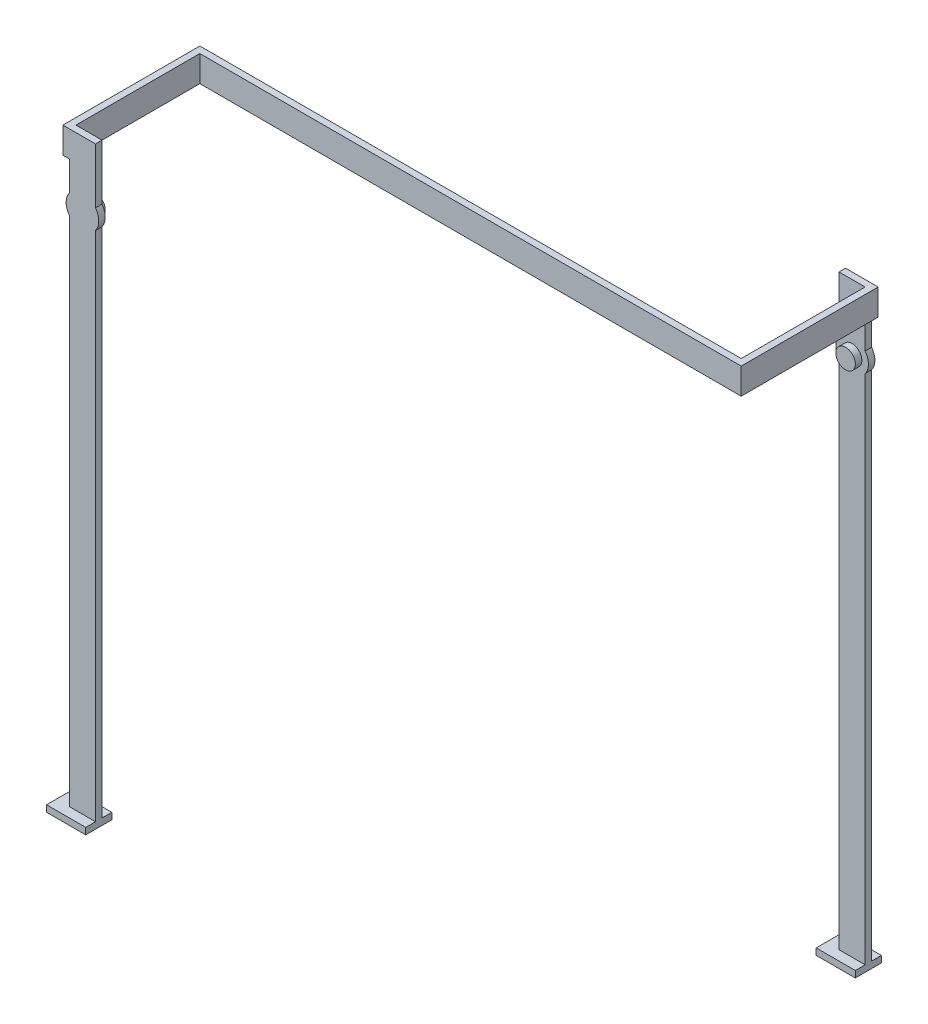
ISO-10303-21;
HEADER;
FILE_DESCRIPTION(('STEP AP214'),'2;1');
FILE_NAME('part.step','',(''),(''),'','','');
FILE_SCHEMA(('AUTOMOTIVE_DESIGN { 1 0 10303 214 1 1 1 1 }'));
ENDSEC;
DATA;
#1=APPLICATION_CONTEXT('core data for automotive mechanical design processes');
#2=APPLICATION_PROTOCOL_DEFINITION('international standard','automotive_design',2000,#1);
#3=PRODUCT_CONTEXT('',#1,'mechanical');
#4=PRODUCT('Part','Part','',(#3));
#5=PRODUCT_RELATED_PRODUCT_CATEGORY('part','',(#4));
#6=PRODUCT_DEFINITION_FORMATION('','',#4);
#7=PRODUCT_DEFINITION_CONTEXT('part definition',#1,'design');
#8=PRODUCT_DEFINITION('design','',#6,#7);
#9=PRODUCT_DEFINITION_SHAPE('','',#8);
#10=(LENGTH_UNIT() NAMED_UNIT(*) SI_UNIT(.MILLI.,.METRE.));
#11=(NAMED_UNIT(*) PLANE_ANGLE_UNIT() SI_UNIT($,.RADIAN.));
#12=(NAMED_UNIT(*) SI_UNIT($,.STERADIAN.) SOLID_ANGLE_UNIT());
#13=UNCERTAINTY_MEASURE_WITH_UNIT(LENGTH_MEASURE(1.E-05),#10,'distance_accuracy_value','');
#14=(GEOMETRIC_REPRESENTATION_CONTEXT(3) GLOBAL_UNCERTAINTY_ASSIGNED_CONTEXT((#13)) GLOBAL_UNIT_ASSIGNED_CONTEXT((#10,
#11,#12)) REPRESENTATION_CONTEXT('',''));
#15=CARTESIAN_POINT('',(0.,0.,0.));
#16=DIRECTION('',(0.,0.,1.));
#17=DIRECTION('',(1.,0.,0.));
#18=AXIS2_PLACEMENT_3D('',#15,#16,#17);
#19=CARTESIAN_POINT('',(25.7222833277674,47.5928129760567,-20.5));
#20=DIRECTION('',(-1.,0.,0.));
#21=DIRECTION('',(0.,0.,1.));
#22=AXIS2_PLACEMENT_3D('',#19,#20,#21);
#23=PLANE('',#22);
#24=DIRECTION('',(0.,0.,-1.));
#25=VECTOR('',#24,1.);
#26=CARTESIAN_POINT('',(25.7222833277674,47.5928129760567,-20.5));
#27=LINE('',#26,#25);
#28=CARTESIAN_POINT('',(25.7222833277674,47.5928129760567,-0.499999999999997));
#29=VERTEX_POINT('',#28);
#30=CARTESIAN_POINT('',(25.7222833277674,47.5928129760567,-19.5));
#31=VERTEX_POINT('',#30);
#32=EDGE_CURVE('E414',#29,#31,#27,.T.);
#33=ORIENTED_EDGE('',*,*,#32,.F.);
#34=DIRECTION('',(0.,1.,0.));
#35=VECTOR('',#34,1.);
#36=CARTESIAN_POINT('',(25.7222833277674,51.5928129760567,-0.5));
#37=LINE('',#36,#35);
#38=CARTESIAN_POINT('',(25.7222833277674,51.5928129760567,-0.5));
#39=VERTEX_POINT('',#38);
#40=EDGE_CURVE('E49',#29,#39,#37,.T.);
#41=ORIENTED_EDGE('',*,*,#40,.T.);
#42=DIRECTION('',(0.,0.,1.));
#43=VECTOR('',#42,1.);
#44=CARTESIAN_POINT('',(25.7222833277674,51.5928129760615,-20.5));
#45=LINE('',#44,#43);
#46=CARTESIAN_POINT('',(25.7222833277674,51.5928129760615,-19.5));
#47=VERTEX_POINT('',#46);
#48=EDGE_CURVE('E409',#47,#39,#45,.T.);
#49=ORIENTED_EDGE('',*,*,#48,.F.);
#50=DIRECTION('',(0.,-1.,0.));
#51=VECTOR('',#50,1.);
#52=CARTESIAN_POINT('',(25.7222833277674,51.5928129760615,-19.5));
#53=LINE('',#52,#51);
#54=EDGE_CURVE('E327',#47,#31,#53,.T.);
#55=ORIENTED_EDGE('',*,*,#54,.T.);
#56=EDGE_LOOP('',(#33,#41,#49,#55));
#57=FACE_BOUND('',#56,.T.);
#58=ADVANCED_FACE('F31',(#57),#23,.T.);
#59=CARTESIAN_POINT('',(25.7222833277674,51.5928129760615,-20.5));
#60=DIRECTION('',(-1.,0.,0.));
#61=DIRECTION('',(0.,-1.,0.));
#62=AXIS2_PLACEMENT_3D('',#59,#60,#61);
#63=PLANE('',#62);
#64=CARTESIAN_POINT('',(25.7222833277674,47.5928129760567,-20.5));
#65=VERTEX_POINT('',#64);
#66=EDGE_CURVE('E422',#31,#65,#27,.T.);
#67=ORIENTED_EDGE('',*,*,#66,.F.);
#68=CARTESIAN_POINT('',(25.7222833277674,43.092812976061,-19.5));
#69=VERTEX_POINT('',#68);
#70=EDGE_CURVE('E333',#31,#69,#53,.T.);
#71=ORIENTED_EDGE('',*,*,#70,.T.);
#72=DIRECTION('',(0.,0.,1.));
#73=VECTOR('',#72,1.);
#74=CARTESIAN_POINT('',(25.7222833277674,43.092812976061,-20.5));
#75=LINE('',#74,#73);
#76=CARTESIAN_POINT('',(25.7222833277674,43.092812976061,-20.5));
#77=VERTEX_POINT('',#76);
#78=EDGE_CURVE('E311',#77,#69,#75,.T.);
#79=ORIENTED_EDGE('',*,*,#78,.F.);
#80=DIRECTION('',(0.,-1.,0.));
#81=VECTOR('',#80,1.);
#82=CARTESIAN_POINT('',(25.7222833277674,51.5928129760615,-20.5));
#83=LINE('',#82,#81);
#84=EDGE_CURVE('E313',#65,#77,#83,.T.);
#85=ORIENTED_EDGE('',*,*,#84,.F.);
#86=EDGE_LOOP('',(#67,#71,#79,#85));
#87=FACE_BOUND('',#86,.T.);
#88=ADVANCED_FACE('F455',(#87),#63,.F.);
#89=CARTESIAN_POINT('',(23.7222833277671,41.5928129760615,-19.5));
#90=DIRECTION('',(0.,0.,-1.));
#91=DIRECTION('',(0.,1.,0.));
#92=AXIS2_PLACEMENT_3D('',#89,#90,#91);
#93=PLANE('',#92);
#94=DIRECTION('',(-1.,0.,0.));
#95=VECTOR('',#94,1.);
#96=CARTESIAN_POINT('',(25.7222833277674,-38.4071870239385,-19.5));
#97=LINE('',#96,#95);
#98=CARTESIAN_POINT('',(25.7222833277674,-38.4071870239431,-19.5));
#99=VERTEX_POINT('',#98);
#100=CARTESIAN_POINT('',(21.7222833277674,-38.4071870239385,-19.5));
#101=VERTEX_POINT('',#100);
#102=EDGE_CURVE('E35',#99,#101,#97,.T.);
#103=ORIENTED_EDGE('',*,*,#102,.F.);
#104=DIRECTION('',(0.,-1.,0.));
#105=VECTOR('',#104,1.);
#106=CARTESIAN_POINT('',(25.7222833277674,40.092812976062,-19.5));
#107=LINE('',#106,#105);
#108=CARTESIAN_POINT('',(25.7222833277674,40.092812976062,-19.5));
#109=VERTEX_POINT('',#108);
#110=EDGE_CURVE('E321',#109,#99,#107,.T.);
#111=ORIENTED_EDGE('',*,*,#110,.F.);
#112=CARTESIAN_POINT('',(23.7222833277671,41.5928129760615,-19.5));
#113=DIRECTION('',(0.,0.,-1.));
#114=DIRECTION('',(0.,1.,0.));
#115=AXIS2_PLACEMENT_3D('',#112,#113,#114);
#116=CIRCLE('',#115,2.49999999999991);
#117=EDGE_CURVE('E322',#69,#109,#116,.T.);
#118=ORIENTED_EDGE('',*,*,#117,.F.);
#119=ORIENTED_EDGE('',*,*,#70,.F.);
#120=ORIENTED_EDGE('',*,*,#54,.F.);
#121=DIRECTION('',(1.,0.,0.));
#122=VECTOR('',#121,1.);
#123=CARTESIAN_POINT('',(25.7222833277674,51.5928129760615,-19.5));
#124=LINE('',#123,#122);
#125=CARTESIAN_POINT('',(21.7222833277674,51.5928129760615,-19.5));
#126=VERTEX_POINT('',#125);
#127=EDGE_CURVE('E446',#126,#47,#124,.T.);
#128=ORIENTED_EDGE('',*,*,#127,.F.);
#129=DIRECTION('',(0.,1.,0.));
#130=VECTOR('',#129,1.);
#131=CARTESIAN_POINT('',(21.7222833277674,51.5928129760615,-19.5));
#132=LINE('',#131,#130);
#133=CARTESIAN_POINT('',(21.7222833277674,43.0928129760617,-19.5));
#134=VERTEX_POINT('',#133);
#135=EDGE_CURVE('E445',#134,#126,#132,.T.);
#136=ORIENTED_EDGE('',*,*,#135,.F.);
#137=CARTESIAN_POINT('',(23.7222833277671,41.5928129760615,-19.5));
#138=DIRECTION('',(0.,0.,-1.));
#139=DIRECTION('',(0.,1.,0.));
#140=AXIS2_PLACEMENT_3D('',#137,#138,#139);
#141=CIRCLE('',#140,2.49999999999992);
#142=CARTESIAN_POINT('',(21.7222833277674,40.0928129760613,-19.5));
#143=VERTEX_POINT('',#142);
#144=EDGE_CURVE('E443',#143,#134,#141,.T.);
#145=ORIENTED_EDGE('',*,*,#144,.F.);
#146=DIRECTION('',(0.,1.,0.));
#147=VECTOR('',#146,1.);
#148=CARTESIAN_POINT('',(21.7222833277674,40.0928129760613,-19.5));
#149=LINE('',#148,#147);
#150=EDGE_CURVE('E441',#101,#143,#149,.T.);
#151=ORIENTED_EDGE('',*,*,#150,.F.);
#152=EDGE_LOOP('',(#103,#111,#118,#119,#120,#128,#136,#145,#151));
#153=FACE_BOUND('',#152,.T.);
#154=CARTESIAN_POINT('',(23.7222833277671,41.5928129760615,-19.5));
#155=DIRECTION('',(0.,0.,-1.));
#156=DIRECTION('',(0.,1.,0.));
#157=AXIS2_PLACEMENT_3D('',#154,#155,#156);
#158=CIRCLE('',#157,1.50000000000001);
#159=CARTESIAN_POINT('',(23.7222833277671,43.0928129760615,-19.5));
#160=VERTEX_POINT('',#159);
#161=EDGE_CURVE('E11',#160,#160,#158,.F.);
#162=ORIENTED_EDGE('',*,*,#161,.F.);
#163=EDGE_LOOP('',(#162));
#164=FACE_BOUND('',#163,.T.);
#165=ADVANCED_FACE('F459',(#153,#164),#93,.F.);
#166=CARTESIAN_POINT('',(21.7222833277674,40.0928129760613,-20.5));
#167=DIRECTION('',(1.,0.,0.));
#168=DIRECTION('',(0.,1.,0.));
#169=AXIS2_PLACEMENT_3D('',#166,#167,#168);
#170=PLANE('',#169);
#171=ORIENTED_EDGE('',*,*,#150,.T.);
#172=DIRECTION('',(0.,0.,1.));
#173=VECTOR('',#172,1.);
#174=CARTESIAN_POINT('',(21.7222833277674,40.0928129760613,-20.5));
#175=LINE('',#174,#173);
#176=CARTESIAN_POINT('',(21.7222833277674,40.0928129760613,-20.5));
#177=VERTEX_POINT('',#176);
#178=EDGE_CURVE('E344',#177,#143,#175,.T.);
#179=ORIENTED_EDGE('',*,*,#178,.F.);
#180=DIRECTION('',(0.,1.,0.));
#181=VECTOR('',#180,1.);
#182=CARTESIAN_POINT('',(21.7222833277674,40.0928129760613,-20.5));
#183=LINE('',#182,#181);
#184=CARTESIAN_POINT('',(21.7222833277674,-38.4071870239385,-20.5));
#185=VERTEX_POINT('',#184);
#186=EDGE_CURVE('E326',#185,#177,#183,.T.);
#187=ORIENTED_EDGE('',*,*,#186,.F.);
#188=DIRECTION('',(0.,0.,1.));
#189=VECTOR('',#188,1.);
#190=CARTESIAN_POINT('',(21.7222833277674,-38.4071870239385,-20.5));
#191=LINE('',#190,#189);
#192=EDGE_CURVE('E41',#185,#101,#191,.T.);
#193=ORIENTED_EDGE('',*,*,#192,.T.);
#194=EDGE_LOOP('',(#171,#179,#187,#193));
#195=FACE_BOUND('',#194,.T.);
#196=ADVANCED_FACE('F33',(#195),#170,.F.);
#197=CARTESIAN_POINT('',(23.7222833277671,41.5928129760615,-20.5));
#198=DIRECTION('',(0.,0.,1.));
#199=DIRECTION('',(0.,-1.,0.));
#200=AXIS2_PLACEMENT_3D('',#197,#198,#199);
#201=CYLINDRICAL_SURFACE('',#200,2.49999999999992);
#202=ORIENTED_EDGE('',*,*,#144,.T.);
#203=DIRECTION('',(0.,0.,1.));
#204=VECTOR('',#203,1.);
#205=CARTESIAN_POINT('',(21.7222833277674,43.0928129760617,-20.5));
#206=LINE('',#205,#204);
#207=CARTESIAN_POINT('',(21.7222833277674,43.0928129760617,-20.5));
#208=VERTEX_POINT('',#207);
#209=EDGE_CURVE('E341',#208,#134,#206,.T.);
#210=ORIENTED_EDGE('',*,*,#209,.F.);
#211=CARTESIAN_POINT('',(23.7222833277671,41.5928129760615,-20.5));
#212=DIRECTION('',(0.,0.,-1.));
#213=DIRECTION('',(0.,1.,0.));
#214=AXIS2_PLACEMENT_3D('',#211,#212,#213);
#215=CIRCLE('',#214,2.49999999999992);
#216=EDGE_CURVE('E433',#177,#208,#215,.T.);
#217=ORIENTED_EDGE('',*,*,#216,.F.);
#218=ORIENTED_EDGE('',*,*,#178,.T.);
#219=EDGE_LOOP('',(#202,#210,#217,#218));
#220=FACE_BOUND('',#219,.T.);
#221=ADVANCED_FACE('F514',(#220),#201,.T.);
#222=CARTESIAN_POINT('',(21.7222833277674,51.5928129760615,-20.5));
#223=DIRECTION('',(1.,0.,0.));
#224=DIRECTION('',(0.,0.,-1.));
#225=AXIS2_PLACEMENT_3D('',#222,#223,#224);
#226=PLANE('',#225);
#227=ORIENTED_EDGE('',*,*,#135,.T.);
#228=DIRECTION('',(0.,0.,1.));
#229=VECTOR('',#228,1.);
#230=CARTESIAN_POINT('',(21.7222833277674,51.5928129760615,-20.5));
#231=LINE('',#230,#229);
#232=CARTESIAN_POINT('',(21.7222833277674,51.5928129760615,-20.5));
#233=VERTEX_POINT('',#232);
#234=EDGE_CURVE('E338',#233,#126,#231,.T.);
#235=ORIENTED_EDGE('',*,*,#234,.F.);
#236=DIRECTION('',(0.,1.,0.));
#237=VECTOR('',#236,1.);
#238=CARTESIAN_POINT('',(21.7222833277674,51.5928129760615,-20.5));
#239=LINE('',#238,#237);
#240=EDGE_CURVE('E435',#208,#233,#239,.T.);
#241=ORIENTED_EDGE('',*,*,#240,.F.);
#242=ORIENTED_EDGE('',*,*,#209,.T.);
#243=EDGE_LOOP('',(#227,#235,#241,#242));
#244=FACE_BOUND('',#243,.T.);
#245=ADVANCED_FACE('F512',(#244),#226,.F.);
#246=CARTESIAN_POINT('',(25.7222833277674,51.5928129760615,-20.5));
#247=DIRECTION('',(0.,-1.,0.));
#248=DIRECTION('',(0.,0.,-1.));
#249=AXIS2_PLACEMENT_3D('',#246,#247,#248);
#250=PLANE('',#249);
#251=ORIENTED_EDGE('',*,*,#127,.T.);
#252=ORIENTED_EDGE('',*,*,#48,.T.);
#253=DIRECTION('',(1.,0.,0.));
#254=VECTOR('',#253,1.);
#255=CARTESIAN_POINT('',(-57.2777166722292,51.592812976057,-0.5));
#256=LINE('',#255,#254);
#257=CARTESIAN_POINT('',(-57.2777166722292,51.592812976057,-0.5));
#258=VERTEX_POINT('',#257);
#259=EDGE_CURVE('E530',#258,#39,#256,.T.);
#260=ORIENTED_EDGE('',*,*,#259,.F.);
#261=DIRECTION('',(0.,0.,-1.));
#262=VECTOR('',#261,1.);
#263=CARTESIAN_POINT('',(-57.2777166722292,51.592812976057,20.5000000000002));
#264=LINE('',#263,#262);
#265=CARTESIAN_POINT('',(-57.2777166722292,51.592812976057,20.5000000000002));
#266=VERTEX_POINT('',#265);
#267=EDGE_CURVE('E533',#266,#258,#264,.T.);
#268=ORIENTED_EDGE('',*,*,#267,.F.);
#269=DIRECTION('',(-1.,0.,0.));
#270=VECTOR('',#269,1.);
#271=CARTESIAN_POINT('',(-56.2777166722293,51.592812976057,20.5000000000002));
#272=LINE('',#271,#270);
#273=CARTESIAN_POINT('',(-52.2777166722293,51.592812976057,20.5000000000002));
#274=VERTEX_POINT('',#273);
#275=EDGE_CURVE('E563',#274,#266,#272,.T.);
#276=ORIENTED_EDGE('',*,*,#275,.F.);
#277=DIRECTION('',(0.,0.,-1.));
#278=VECTOR('',#277,1.);
#279=CARTESIAN_POINT('',(-52.2777166722293,51.592812976057,20.5000000000002));
#280=LINE('',#279,#278);
#281=CARTESIAN_POINT('',(-52.2777166722293,51.592812976057,19.5000000000002));
#282=VERTEX_POINT('',#281);
#283=EDGE_CURVE('E397',#274,#282,#280,.T.);
#284=ORIENTED_EDGE('',*,*,#283,.T.);
#285=DIRECTION('',(-1.,0.,0.));
#286=VECTOR('',#285,1.);
#287=CARTESIAN_POINT('',(-56.2777166722293,51.592812976057,19.5000000000002));
#288=LINE('',#287,#286);
#289=CARTESIAN_POINT('',(-56.2777166722292,51.592812976057,19.5000000000002));
#290=VERTEX_POINT('',#289);
#291=EDGE_CURVE('E377',#282,#290,#288,.T.);
#292=ORIENTED_EDGE('',*,*,#291,.T.);
#293=DIRECTION('',(0.,0.,-1.));
#294=VECTOR('',#293,1.);
#295=CARTESIAN_POINT('',(-56.2777166722292,51.592812976057,20.5000000000002));
#296=LINE('',#295,#294);
#297=CARTESIAN_POINT('',(-56.2777166722293,51.592812976057,0.5));
#298=VERTEX_POINT('',#297);
#299=EDGE_CURVE('E549',#290,#298,#296,.T.);
#300=ORIENTED_EDGE('',*,*,#299,.T.);
#301=DIRECTION('',(-1.,0.,0.));
#302=VECTOR('',#301,1.);
#303=CARTESIAN_POINT('',(26.7222833277674,51.5928129760615,0.500000000000001));
#304=LINE('',#303,#302);
#305=CARTESIAN_POINT('',(26.7222833277674,51.5928129760615,0.500000000000001));
#306=VERTEX_POINT('',#305);
#307=EDGE_CURVE('E427',#306,#298,#304,.T.);
#308=ORIENTED_EDGE('',*,*,#307,.F.);
#309=DIRECTION('',(0.,0.,1.));
#310=VECTOR('',#309,1.);
#311=CARTESIAN_POINT('',(26.7222833277674,51.5928129760615,-20.5));
#312=LINE('',#311,#310);
#313=CARTESIAN_POINT('',(26.7222833277674,51.5928129760615,-20.5));
#314=VERTEX_POINT('',#313);
#315=EDGE_CURVE('E413',#314,#306,#312,.T.);
#316=ORIENTED_EDGE('',*,*,#315,.F.);
#317=DIRECTION('',(1.,0.,0.));
#318=VECTOR('',#317,1.);
#319=CARTESIAN_POINT('',(25.7222833277674,51.5928129760615,-20.5));
#320=LINE('',#319,#318);
#321=EDGE_CURVE('E437',#233,#314,#320,.T.);
#322=ORIENTED_EDGE('',*,*,#321,.F.);
#323=ORIENTED_EDGE('',*,*,#234,.T.);
#324=EDGE_LOOP('',(#251,#252,#260,#268,#276,#284,#292,#300,#308,#316,#322,#323));
#325=FACE_BOUND('',#324,.T.);
#326=ADVANCED_FACE('F508',(#325),#250,.F.);
#327=CARTESIAN_POINT('',(23.7222833277671,41.5928129760615,-20.5));
#328=DIRECTION('',(0.,0.,1.));
#329=DIRECTION('',(0.,-1.,0.));
#330=AXIS2_PLACEMENT_3D('',#327,#328,#329);
#331=CYLINDRICAL_SURFACE('',#330,2.49999999999991);
#332=ORIENTED_EDGE('',*,*,#117,.T.);
#333=DIRECTION('',(0.,0.,1.));
#334=VECTOR('',#333,1.);
#335=CARTESIAN_POINT('',(25.7222833277674,40.092812976062,-20.5));
#336=LINE('',#335,#334);
#337=CARTESIAN_POINT('',(25.7222833277674,40.092812976062,-20.5));
#338=VERTEX_POINT('',#337);
#339=EDGE_CURVE('E309',#338,#109,#336,.T.);
#340=ORIENTED_EDGE('',*,*,#339,.F.);
#341=CARTESIAN_POINT('',(23.7222833277671,41.5928129760615,-20.5));
#342=DIRECTION('',(0.,0.,-1.));
#343=DIRECTION('',(0.,1.,0.));
#344=AXIS2_PLACEMENT_3D('',#341,#342,#343);
#345=CIRCLE('',#344,2.49999999999991);
#346=EDGE_CURVE('E307',#77,#338,#345,.T.);
#347=ORIENTED_EDGE('',*,*,#346,.F.);
#348=ORIENTED_EDGE('',*,*,#78,.T.);
#349=EDGE_LOOP('',(#332,#340,#347,#348));
#350=FACE_BOUND('',#349,.T.);
#351=ADVANCED_FACE('F458',(#350),#331,.T.);
#352=CARTESIAN_POINT('',(25.7222833277674,40.092812976062,-20.5));
#353=DIRECTION('',(-1.,0.,0.));
#354=DIRECTION('',(0.,-1.,0.));
#355=AXIS2_PLACEMENT_3D('',#352,#353,#354);
#356=PLANE('',#355);
#357=ORIENTED_EDGE('',*,*,#110,.T.);
#358=DIRECTION('',(0.,0.,1.));
#359=VECTOR('',#358,1.);
#360=CARTESIAN_POINT('',(25.7222833277674,-38.4071870239431,-22.));
#361=LINE('',#360,#359);
#362=CARTESIAN_POINT('',(25.7222833277674,-38.4071870239431,-18.));
#363=VERTEX_POINT('',#362);
#364=EDGE_CURVE('E262',#99,#363,#361,.T.);
#365=ORIENTED_EDGE('',*,*,#364,.T.);
#366=DIRECTION('',(0.,1.,0.));
#367=VECTOR('',#366,1.);
#368=CARTESIAN_POINT('',(25.7222833277674,-39.4071870239431,-18.));
#369=LINE('',#368,#367);
#370=CARTESIAN_POINT('',(25.7222833277674,-39.4071870239431,-18.));
#371=VERTEX_POINT('',#370);
#372=EDGE_CURVE('E243',#371,#363,#369,.T.);
#373=ORIENTED_EDGE('',*,*,#372,.F.);
#374=DIRECTION('',(0.,0.,1.));
#375=VECTOR('',#374,1.);
#376=CARTESIAN_POINT('',(25.7222833277674,-39.4071870239431,-22.));
#377=LINE('',#376,#375);
#378=CARTESIAN_POINT('',(25.7222833277674,-39.4071870239431,-22.));
#379=VERTEX_POINT('',#378);
#380=EDGE_CURVE('E249',#379,#371,#377,.T.);
#381=ORIENTED_EDGE('',*,*,#380,.F.);
#382=DIRECTION('',(0.,1.,0.));
#383=VECTOR('',#382,1.);
#384=CARTESIAN_POINT('',(25.7222833277674,-39.4071870239431,-22.));
#385=LINE('',#384,#383);
#386=CARTESIAN_POINT('',(25.7222833277674,-38.4071870239431,-22.));
#387=VERTEX_POINT('',#386);
#388=EDGE_CURVE('E288',#379,#387,#385,.T.);
#389=ORIENTED_EDGE('',*,*,#388,.T.);
#390=CARTESIAN_POINT('',(25.7222833277674,-38.4071870239431,-20.5));
#391=VERTEX_POINT('',#390);
#392=EDGE_CURVE('E273',#387,#391,#361,.T.);
#393=ORIENTED_EDGE('',*,*,#392,.T.);
#394=DIRECTION('',(0.,-1.,0.));
#395=VECTOR('',#394,1.);
#396=CARTESIAN_POINT('',(25.7222833277674,40.092812976062,-20.5));
#397=LINE('',#396,#395);
#398=EDGE_CURVE('E304',#338,#391,#397,.T.);
#399=ORIENTED_EDGE('',*,*,#398,.F.);
#400=ORIENTED_EDGE('',*,*,#339,.T.);
#401=EDGE_LOOP('',(#357,#365,#373,#381,#389,#393,#399,#400));
#402=FACE_BOUND('',#401,.T.);
#403=ADVANCED_FACE('F261',(#402),#356,.F.);
#404=CARTESIAN_POINT('',(23.7222833277671,41.5928129760615,-20.5));
#405=DIRECTION('',(0.,0.,-1.));
#406=DIRECTION('',(0.,1.,0.));
#407=AXIS2_PLACEMENT_3D('',#404,#405,#406);
#408=PLANE('',#407);
#409=DIRECTION('',(-1.,0.,0.));
#410=VECTOR('',#409,1.);
#411=CARTESIAN_POINT('',(25.7222833277674,-38.4071870239385,-20.5));
#412=LINE('',#411,#410);
#413=EDGE_CURVE('E300',#391,#185,#412,.T.);
#414=ORIENTED_EDGE('',*,*,#413,.T.);
#415=ORIENTED_EDGE('',*,*,#186,.T.);
#416=ORIENTED_EDGE('',*,*,#216,.T.);
#417=ORIENTED_EDGE('',*,*,#240,.T.);
#418=ORIENTED_EDGE('',*,*,#321,.T.);
#419=DIRECTION('',(0.,1.,0.));
#420=VECTOR('',#419,1.);
#421=CARTESIAN_POINT('',(26.7222833277674,51.5928129760615,-20.5));
#422=LINE('',#421,#420);
#423=CARTESIAN_POINT('',(26.7222833277674,47.5928129760567,-20.5));
#424=VERTEX_POINT('',#423);
#425=EDGE_CURVE('E410',#424,#314,#422,.T.);
#426=ORIENTED_EDGE('',*,*,#425,.F.);
#427=DIRECTION('',(-1.,0.,0.));
#428=VECTOR('',#427,1.);
#429=CARTESIAN_POINT('',(26.7222833277674,47.5928129760567,-20.5));
#430=LINE('',#429,#428);
#431=EDGE_CURVE('E57',#424,#65,#430,.T.);
#432=ORIENTED_EDGE('',*,*,#431,.T.);
#433=ORIENTED_EDGE('',*,*,#84,.T.);
#434=ORIENTED_EDGE('',*,*,#346,.T.);
#435=ORIENTED_EDGE('',*,*,#398,.T.);
#436=EDGE_LOOP('',(#414,#415,#416,#417,#418,#426,#432,#433,#434,#435));
#437=FACE_BOUND('',#436,.T.);
#438=ADVANCED_FACE('F305',(#437),#408,.T.);
#439=CARTESIAN_POINT('',(23.7222833277671,41.5928129760615,-18.5));
#440=DIRECTION('',(0.,0.,-1.));
#441=DIRECTION('',(-1.,0.,0.));
#442=AXIS2_PLACEMENT_3D('',#439,#440,#441);
#443=CYLINDRICAL_SURFACE('',#442,1.50000000000001);
#444=CARTESIAN_POINT('',(23.7222833277671,41.5928129760615,-18.5));
#445=DIRECTION('',(0.,0.,1.));
#446=DIRECTION('',(1.,0.,0.));
#447=AXIS2_PLACEMENT_3D('',#444,#445,#446);
#448=CIRCLE('',#447,1.50000000000001);
#449=CARTESIAN_POINT('',(25.2222833277672,41.5928129760615,-18.5));
#450=VERTEX_POINT('',#449);
#451=EDGE_CURVE('E429',#450,#450,#448,.T.);
#452=ORIENTED_EDGE('',*,*,#451,.F.);
#453=EDGE_LOOP('',(#452));
#454=FACE_BOUND('',#453,.T.);
#455=ORIENTED_EDGE('',*,*,#161,.T.);
#456=EDGE_LOOP('',(#455));
#457=FACE_BOUND('',#456,.T.);
#458=ADVANCED_FACE('F496',(#454,#457),#443,.T.);
#459=CARTESIAN_POINT('',(23.7222833277671,41.5928129760615,-18.5));
#460=DIRECTION('',(0.,0.,1.));
#461=DIRECTION('',(1.,0.,0.));
#462=AXIS2_PLACEMENT_3D('',#459,#460,#461);
#463=PLANE('',#462);
#464=ORIENTED_EDGE('',*,*,#451,.T.);
#465=EDGE_LOOP('',(#464));
#466=FACE_BOUND('',#465,.T.);
#467=ADVANCED_FACE('F492',(#466),#463,.T.);
#468=CARTESIAN_POINT('',(26.7222833277674,51.5928129760615,0.500000000000001));
#469=DIRECTION('',(0.,0.,-1.));
#470=DIRECTION('',(0.,1.,0.));
#471=AXIS2_PLACEMENT_3D('',#468,#469,#470);
#472=PLANE('',#471);
#473=ORIENTED_EDGE('',*,*,#307,.T.);
#474=DIRECTION('',(0.,-1.,0.));
#475=VECTOR('',#474,1.);
#476=CARTESIAN_POINT('',(-56.2777166722293,51.592812976057,0.5));
#477=LINE('',#476,#475);
#478=CARTESIAN_POINT('',(-56.2777166722292,47.592812976057,0.499999999999997));
#479=VERTEX_POINT('',#478);
#480=EDGE_CURVE('E553',#298,#479,#477,.T.);
#481=ORIENTED_EDGE('',*,*,#480,.T.);
#482=DIRECTION('',(-1.,0.,0.));
#483=VECTOR('',#482,1.);
#484=CARTESIAN_POINT('',(26.7222833277674,47.5928129760567,0.5));
#485=LINE('',#484,#483);
#486=CARTESIAN_POINT('',(26.7222833277674,47.5928129760567,0.5));
#487=VERTEX_POINT('',#486);
#488=EDGE_CURVE('E425',#487,#479,#485,.T.);
#489=ORIENTED_EDGE('',*,*,#488,.F.);
#490=DIRECTION('',(0.,-1.,0.));
#491=VECTOR('',#490,1.);
#492=CARTESIAN_POINT('',(26.7222833277674,51.5928129760615,0.500000000000001));
#493=LINE('',#492,#491);
#494=EDGE_CURVE('E416',#306,#487,#493,.T.);
#495=ORIENTED_EDGE('',*,*,#494,.F.);
#496=EDGE_LOOP('',(#473,#481,#489,#495));
#497=FACE_BOUND('',#496,.T.);
#498=ADVANCED_FACE('F488',(#497),#472,.F.);
#499=CARTESIAN_POINT('',(26.7222833277674,47.5928129760567,-20.5));
#500=DIRECTION('',(0.,1.,0.));
#501=DIRECTION('',(0.,0.,1.));
#502=AXIS2_PLACEMENT_3D('',#499,#500,#501);
#503=PLANE('',#502);
#504=ORIENTED_EDGE('',*,*,#488,.T.);
#505=DIRECTION('',(0.,0.,1.));
#506=VECTOR('',#505,1.);
#507=CARTESIAN_POINT('',(-56.2777166722292,47.592812976057,20.5000000000002));
#508=LINE('',#507,#506);
#509=CARTESIAN_POINT('',(-56.2777166722292,47.592812976057,19.5000000000002));
#510=VERTEX_POINT('',#509);
#511=EDGE_CURVE('E554',#479,#510,#508,.T.);
#512=ORIENTED_EDGE('',*,*,#511,.T.);
#513=CARTESIAN_POINT('',(-56.2777166722293,47.592812976057,20.5000000000002));
#514=VERTEX_POINT('',#513);
#515=EDGE_CURVE('E552',#510,#514,#508,.T.);
#516=ORIENTED_EDGE('',*,*,#515,.T.);
#517=DIRECTION('',(1.,0.,0.));
#518=VECTOR('',#517,1.);
#519=CARTESIAN_POINT('',(-57.2777166722292,47.592812976057,20.5000000000002));
#520=LINE('',#519,#518);
#521=CARTESIAN_POINT('',(-57.2777166722292,47.592812976057,20.5000000000002));
#522=VERTEX_POINT('',#521);
#523=EDGE_CURVE('E543',#522,#514,#520,.T.);
#524=ORIENTED_EDGE('',*,*,#523,.F.);
#525=DIRECTION('',(0.,0.,1.));
#526=VECTOR('',#525,1.);
#527=CARTESIAN_POINT('',(-57.2777166722292,47.592812976057,20.5000000000002));
#528=LINE('',#527,#526);
#529=CARTESIAN_POINT('',(-57.2777166722292,47.592812976057,-0.5));
#530=VERTEX_POINT('',#529);
#531=EDGE_CURVE('E541',#530,#522,#528,.T.);
#532=ORIENTED_EDGE('',*,*,#531,.F.);
#533=DIRECTION('',(1.,0.,0.));
#534=VECTOR('',#533,1.);
#535=CARTESIAN_POINT('',(-57.2777166722292,47.592812976057,-0.5));
#536=LINE('',#535,#534);
#537=EDGE_CURVE('E535',#530,#29,#536,.T.);
#538=ORIENTED_EDGE('',*,*,#537,.T.);
#539=ORIENTED_EDGE('',*,*,#32,.T.);
#540=ORIENTED_EDGE('',*,*,#66,.T.);
#541=ORIENTED_EDGE('',*,*,#431,.F.);
#542=DIRECTION('',(0.,0.,-1.));
#543=VECTOR('',#542,1.);
#544=CARTESIAN_POINT('',(26.7222833277674,47.5928129760567,-20.5));
#545=LINE('',#544,#543);
#546=EDGE_CURVE('E418',#487,#424,#545,.T.);
#547=ORIENTED_EDGE('',*,*,#546,.F.);
#548=EDGE_LOOP('',(#504,#512,#516,#524,#532,#538,#539,#540,#541,#547));
#549=FACE_BOUND('',#548,.T.);
#550=ADVANCED_FACE('F485',(#549),#503,.F.);
#551=CARTESIAN_POINT('',(26.7222833277674,47.5928129760567,-20.5));
#552=DIRECTION('',(-1.,0.,0.));
#553=DIRECTION('',(0.,0.,1.));
#554=AXIS2_PLACEMENT_3D('',#551,#552,#553);
#555=PLANE('',#554);
#556=ORIENTED_EDGE('',*,*,#425,.T.);
#557=ORIENTED_EDGE('',*,*,#315,.T.);
#558=ORIENTED_EDGE('',*,*,#494,.T.);
#559=ORIENTED_EDGE('',*,*,#546,.T.);
#560=EDGE_LOOP('',(#556,#557,#558,#559));
#561=FACE_BOUND('',#560,.T.);
#562=ADVANCED_FACE('F483',(#561),#555,.F.);
#563=CARTESIAN_POINT('',(-56.2777166722293,51.592812976057,20.5000000000002));
#564=DIRECTION('',(1.,0.,0.));
#565=DIRECTION('',(0.,1.,0.));
#566=AXIS2_PLACEMENT_3D('',#563,#564,#565);
#567=PLANE('',#566);
#568=ORIENTED_EDGE('',*,*,#515,.F.);
#569=DIRECTION('',(0.,-1.,0.));
#570=VECTOR('',#569,1.);
#571=CARTESIAN_POINT('',(-56.2777166722293,51.592812976057,19.5000000000002));
#572=LINE('',#571,#570);
#573=CARTESIAN_POINT('',(-56.2777166722293,43.0928129760537,19.5000000000002));
#574=VERTEX_POINT('',#573);
#575=EDGE_CURVE('E380',#510,#574,#572,.T.);
#576=ORIENTED_EDGE('',*,*,#575,.T.);
#577=DIRECTION('',(0.,0.,-1.));
#578=VECTOR('',#577,1.);
#579=CARTESIAN_POINT('',(-56.2777166722293,43.0928129760537,20.5000000000002));
#580=LINE('',#579,#578);
#581=CARTESIAN_POINT('',(-56.2777166722293,43.0928129760537,20.5000000000002));
#582=VERTEX_POINT('',#581);
#583=EDGE_CURVE('E394',#582,#574,#580,.T.);
#584=ORIENTED_EDGE('',*,*,#583,.F.);
#585=DIRECTION('',(0.,-1.,0.));
#586=VECTOR('',#585,1.);
#587=CARTESIAN_POINT('',(-56.2777166722293,51.592812976057,20.5000000000002));
#588=LINE('',#587,#586);
#589=EDGE_CURVE('E565',#514,#582,#588,.T.);
#590=ORIENTED_EDGE('',*,*,#589,.F.);
#591=EDGE_LOOP('',(#568,#576,#584,#590));
#592=FACE_BOUND('',#591,.T.);
#593=ADVANCED_FACE('F637',(#592),#567,.F.);
#594=CARTESIAN_POINT('',(-54.2777166722323,41.5928129760568,19.5000000000002));
#595=DIRECTION('',(0.,0.,1.));
#596=DIRECTION('',(1.,0.,0.));
#597=AXIS2_PLACEMENT_3D('',#594,#595,#596);
#598=PLANE('',#597);
#599=DIRECTION('',(1.,0.,0.));
#600=VECTOR('',#599,1.);
#601=CARTESIAN_POINT('',(-56.2777166722293,-38.4071870239431,19.5000000000002));
#602=LINE('',#601,#600);
#603=CARTESIAN_POINT('',(-56.2777166722293,-38.4071870239431,19.5000000000002));
#604=VERTEX_POINT('',#603);
#605=CARTESIAN_POINT('',(-52.2777166722293,-38.4071870239431,19.5000000000002));
#606=VERTEX_POINT('',#605);
#607=EDGE_CURVE('E363',#604,#606,#602,.T.);
#608=ORIENTED_EDGE('',*,*,#607,.F.);
#609=DIRECTION('',(0.,-1.,0.));
#610=VECTOR('',#609,1.);
#611=CARTESIAN_POINT('',(-56.2777166722293,40.0928129760603,19.5000000000002));
#612=LINE('',#611,#610);
#613=CARTESIAN_POINT('',(-56.2777166722294,40.0928129760602,19.5000000000002));
#614=VERTEX_POINT('',#613);
#615=EDGE_CURVE('E357',#614,#604,#612,.T.);
#616=ORIENTED_EDGE('',*,*,#615,.F.);
#617=CARTESIAN_POINT('',(-54.2777166722323,41.5928129760568,19.5000000000002));
#618=DIRECTION('',(0.,0.,1.));
#619=DIRECTION('',(1.,0.,0.));
#620=AXIS2_PLACEMENT_3D('',#617,#618,#619);
#621=CIRCLE('',#620,2.49999999999558);
#622=EDGE_CURVE('E384',#574,#614,#621,.T.);
#623=ORIENTED_EDGE('',*,*,#622,.F.);
#624=ORIENTED_EDGE('',*,*,#575,.F.);
#625=EDGE_CURVE('E381',#290,#510,#572,.T.);
#626=ORIENTED_EDGE('',*,*,#625,.F.);
#627=ORIENTED_EDGE('',*,*,#291,.F.);
#628=DIRECTION('',(0.,1.,0.));
#629=VECTOR('',#628,1.);
#630=CARTESIAN_POINT('',(-52.2777166722293,51.592812976057,19.5000000000002));
#631=LINE('',#630,#629);
#632=CARTESIAN_POINT('',(-52.2777166722294,43.0928129760477,19.5000000000002));
#633=VERTEX_POINT('',#632);
#634=EDGE_CURVE('E375',#633,#282,#631,.T.);
#635=ORIENTED_EDGE('',*,*,#634,.F.);
#636=CARTESIAN_POINT('',(-54.2777166722323,41.5928129760568,19.5000000000002));
#637=DIRECTION('',(0.,0.,1.));
#638=DIRECTION('',(1.,0.,0.));
#639=AXIS2_PLACEMENT_3D('',#636,#637,#638);
#640=CIRCLE('',#639,2.49999999999691);
#641=CARTESIAN_POINT('',(-52.2777166722293,40.0928129760661,19.5000000000002));
#642=VERTEX_POINT('',#641);
#643=EDGE_CURVE('E362',#642,#633,#640,.T.);
#644=ORIENTED_EDGE('',*,*,#643,.F.);
#645=DIRECTION('',(0.,1.,0.));
#646=VECTOR('',#645,1.);
#647=CARTESIAN_POINT('',(-52.2777166722293,40.0928129760661,19.5000000000002));
#648=LINE('',#647,#646);
#649=EDGE_CURVE('E360',#606,#642,#648,.T.);
#650=ORIENTED_EDGE('',*,*,#649,.F.);
#651=EDGE_LOOP('',(#608,#616,#623,#624,#626,#627,#635,#644,#650));
#652=FACE_BOUND('',#651,.T.);
#653=CARTESIAN_POINT('',(-54.2777166722323,41.5928129760568,19.5000000000002));
#654=DIRECTION('',(0.,0.,1.));
#655=DIRECTION('',(1.,0.,0.));
#656=AXIS2_PLACEMENT_3D('',#653,#654,#655);
#657=CIRCLE('',#656,1.49999999999932);
#658=CARTESIAN_POINT('',(-52.777716672233,41.5928129760568,19.5000000000002));
#659=VERTEX_POINT('',#658);
#660=EDGE_CURVE('E406',#659,#659,#657,.F.);
#661=ORIENTED_EDGE('',*,*,#660,.F.);
#662=EDGE_LOOP('',(#661));
#663=FACE_BOUND('',#662,.T.);
#664=ADVANCED_FACE('F625',(#652,#663),#598,.F.);
#665=CARTESIAN_POINT('',(-52.2777166722293,40.0928129760661,20.5000000000002));
#666=DIRECTION('',(-1.,0.,0.));
#667=DIRECTION('',(0.,-1.,0.));
#668=AXIS2_PLACEMENT_3D('',#665,#666,#667);
#669=PLANE('',#668);
#670=ORIENTED_EDGE('',*,*,#649,.T.);
#671=DIRECTION('',(0.,0.,-1.));
#672=VECTOR('',#671,1.);
#673=CARTESIAN_POINT('',(-52.2777166722293,40.0928129760661,20.5000000000002));
#674=LINE('',#673,#672);
#675=CARTESIAN_POINT('',(-52.2777166722293,40.0928129760661,20.5000000000002));
#676=VERTEX_POINT('',#675);
#677=EDGE_CURVE('E403',#676,#642,#674,.T.);
#678=ORIENTED_EDGE('',*,*,#677,.F.);
#679=DIRECTION('',(0.,1.,0.));
#680=VECTOR('',#679,1.);
#681=CARTESIAN_POINT('',(-52.2777166722293,40.0928129760661,20.5000000000002));
#682=LINE('',#681,#680);
#683=CARTESIAN_POINT('',(-52.2777166722293,-38.4071870239431,20.5000000000002));
#684=VERTEX_POINT('',#683);
#685=EDGE_CURVE('E349',#684,#676,#682,.T.);
#686=ORIENTED_EDGE('',*,*,#685,.F.);
#687=DIRECTION('',(0.,0.,1.));
#688=VECTOR('',#687,1.);
#689=CARTESIAN_POINT('',(-52.2777166722293,-38.4071870239431,22.0000000000002));
#690=LINE('',#689,#688);
#691=CARTESIAN_POINT('',(-52.2777166722293,-38.4071870239431,22.0000000000002));
#692=VERTEX_POINT('',#691);
#693=EDGE_CURVE('E581',#684,#692,#690,.T.);
#694=ORIENTED_EDGE('',*,*,#693,.T.);
#695=DIRECTION('',(0.,1.,0.));
#696=VECTOR('',#695,1.);
#697=CARTESIAN_POINT('',(-52.2777166722293,-39.4071870239431,22.0000000000002));
#698=LINE('',#697,#696);
#699=CARTESIAN_POINT('',(-52.2777166722293,-39.4071870239431,22.0000000000002));
#700=VERTEX_POINT('',#699);
#701=EDGE_CURVE('E604',#700,#692,#698,.T.);
#702=ORIENTED_EDGE('',*,*,#701,.F.);
#703=DIRECTION('',(0.,0.,1.));
#704=VECTOR('',#703,1.);
#705=CARTESIAN_POINT('',(-52.2777166722293,-39.4071870239431,22.0000000000002));
#706=LINE('',#705,#704);
#707=CARTESIAN_POINT('',(-52.2777166722293,-39.4071870239431,18.0000000000002));
#708=VERTEX_POINT('',#707);
#709=EDGE_CURVE('E676',#708,#700,#706,.T.);
#710=ORIENTED_EDGE('',*,*,#709,.F.);
#711=DIRECTION('',(0.,1.,0.));
#712=VECTOR('',#711,1.);
#713=CARTESIAN_POINT('',(-52.2777166722293,-39.4071870239431,18.0000000000002));
#714=LINE('',#713,#712);
#715=CARTESIAN_POINT('',(-52.2777166722293,-38.4071870239431,18.0000000000002));
#716=VERTEX_POINT('',#715);
#717=EDGE_CURVE('E607',#708,#716,#714,.T.);
#718=ORIENTED_EDGE('',*,*,#717,.T.);
#719=EDGE_CURVE('E587',#716,#606,#690,.T.);
#720=ORIENTED_EDGE('',*,*,#719,.T.);
#721=EDGE_LOOP('',(#670,#678,#686,#694,#702,#710,#718,#720));
#722=FACE_BOUND('',#721,.T.);
#723=ADVANCED_FACE('F654',(#722),#669,.F.);
#724=CARTESIAN_POINT('',(-54.2777166722323,41.5928129760568,20.5000000000002));
#725=DIRECTION('',(0.,0.,-1.));
#726=DIRECTION('',(-1.,0.,0.));
#727=AXIS2_PLACEMENT_3D('',#724,#725,#726);
#728=CYLINDRICAL_SURFACE('',#727,2.49999999999691);
#729=ORIENTED_EDGE('',*,*,#643,.T.);
#730=DIRECTION('',(0.,0.,-1.));
#731=VECTOR('',#730,1.);
#732=CARTESIAN_POINT('',(-52.2777166722294,43.0928129760477,20.5000000000002));
#733=LINE('',#732,#731);
#734=CARTESIAN_POINT('',(-52.2777166722294,43.0928129760477,20.5000000000002));
#735=VERTEX_POINT('',#734);
#736=EDGE_CURVE('E400',#735,#633,#733,.T.);
#737=ORIENTED_EDGE('',*,*,#736,.F.);
#738=CARTESIAN_POINT('',(-54.2777166722323,41.5928129760568,20.5000000000002));
#739=DIRECTION('',(0.,0.,1.));
#740=DIRECTION('',(1.,0.,0.));
#741=AXIS2_PLACEMENT_3D('',#738,#739,#740);
#742=CIRCLE('',#741,2.49999999999691);
#743=EDGE_CURVE('E351',#676,#735,#742,.T.);
#744=ORIENTED_EDGE('',*,*,#743,.F.);
#745=ORIENTED_EDGE('',*,*,#677,.T.);
#746=EDGE_LOOP('',(#729,#737,#744,#745));
#747=FACE_BOUND('',#746,.T.);
#748=ADVANCED_FACE('F663',(#747),#728,.T.);
#749=CARTESIAN_POINT('',(-52.2777166722293,51.592812976057,20.5000000000002));
#750=DIRECTION('',(-1.,0.,0.));
#751=DIRECTION('',(0.,-1.,0.));
#752=AXIS2_PLACEMENT_3D('',#749,#750,#751);
#753=PLANE('',#752);
#754=ORIENTED_EDGE('',*,*,#634,.T.);
#755=ORIENTED_EDGE('',*,*,#283,.F.);
#756=DIRECTION('',(0.,1.,0.));
#757=VECTOR('',#756,1.);
#758=CARTESIAN_POINT('',(-52.2777166722293,51.592812976057,20.5000000000002));
#759=LINE('',#758,#757);
#760=EDGE_CURVE('E561',#735,#274,#759,.T.);
#761=ORIENTED_EDGE('',*,*,#760,.F.);
#762=ORIENTED_EDGE('',*,*,#736,.T.);
#763=EDGE_LOOP('',(#754,#755,#761,#762));
#764=FACE_BOUND('',#763,.T.);
#765=ADVANCED_FACE('F660',(#764),#753,.F.);
#766=CARTESIAN_POINT('',(-54.2777166722323,41.5928129760568,20.5000000000002));
#767=DIRECTION('',(0.,0.,-1.));
#768=DIRECTION('',(-1.,0.,0.));
#769=AXIS2_PLACEMENT_3D('',#766,#767,#768);
#770=CYLINDRICAL_SURFACE('',#769,2.49999999999558);
#771=ORIENTED_EDGE('',*,*,#622,.T.);
#772=DIRECTION('',(0.,0.,-1.));
#773=VECTOR('',#772,1.);
#774=CARTESIAN_POINT('',(-56.2777166722294,40.0928129760602,20.5000000000002));
#775=LINE('',#774,#773);
#776=CARTESIAN_POINT('',(-56.2777166722294,40.0928129760602,20.5000000000002));
#777=VERTEX_POINT('',#776);
#778=EDGE_CURVE('E391',#777,#614,#775,.T.);
#779=ORIENTED_EDGE('',*,*,#778,.F.);
#780=CARTESIAN_POINT('',(-54.2777166722323,41.5928129760568,20.5000000000002));
#781=DIRECTION('',(0.,0.,1.));
#782=DIRECTION('',(1.,0.,0.));
#783=AXIS2_PLACEMENT_3D('',#780,#781,#782);
#784=CIRCLE('',#783,2.49999999999558);
#785=EDGE_CURVE('E566',#582,#777,#784,.T.);
#786=ORIENTED_EDGE('',*,*,#785,.F.);
#787=ORIENTED_EDGE('',*,*,#583,.T.);
#788=EDGE_LOOP('',(#771,#779,#786,#787));
#789=FACE_BOUND('',#788,.T.);
#790=ADVANCED_FACE('F658',(#789),#770,.T.);
#791=CARTESIAN_POINT('',(-56.2777166722293,40.0928129760603,20.5000000000002));
#792=DIRECTION('',(1.,0.,0.));
#793=DIRECTION('',(0.,1.,0.));
#794=AXIS2_PLACEMENT_3D('',#791,#792,#793);
#795=PLANE('',#794);
#796=ORIENTED_EDGE('',*,*,#615,.T.);
#797=DIRECTION('',(0.,0.,-1.));
#798=VECTOR('',#797,1.);
#799=CARTESIAN_POINT('',(-56.2777166722293,-38.4071870239431,20.5000000000002));
#800=LINE('',#799,#798);
#801=CARTESIAN_POINT('',(-56.2777166722293,-38.4071870239431,20.5000000000002));
#802=VERTEX_POINT('',#801);
#803=EDGE_CURVE('E388',#802,#604,#800,.T.);
#804=ORIENTED_EDGE('',*,*,#803,.F.);
#805=DIRECTION('',(0.,-1.,0.));
#806=VECTOR('',#805,1.);
#807=CARTESIAN_POINT('',(-56.2777166722293,40.0928129760603,20.5000000000002));
#808=LINE('',#807,#806);
#809=EDGE_CURVE('E372',#777,#802,#808,.T.);
#810=ORIENTED_EDGE('',*,*,#809,.F.);
#811=ORIENTED_EDGE('',*,*,#778,.T.);
#812=EDGE_LOOP('',(#796,#804,#810,#811));
#813=FACE_BOUND('',#812,.T.);
#814=ADVANCED_FACE('F576',(#813),#795,.F.);
#815=CARTESIAN_POINT('',(-54.2777166722323,41.5928129760568,20.5000000000002));
#816=DIRECTION('',(0.,0.,1.));
#817=DIRECTION('',(1.,0.,0.));
#818=AXIS2_PLACEMENT_3D('',#815,#816,#817);
#819=PLANE('',#818);
#820=DIRECTION('',(1.,0.,0.));
#821=VECTOR('',#820,1.);
#822=CARTESIAN_POINT('',(-56.2777166722293,-38.4071870239431,20.5000000000002));
#823=LINE('',#822,#821);
#824=EDGE_CURVE('E352',#802,#684,#823,.T.);
#825=ORIENTED_EDGE('',*,*,#824,.T.);
#826=ORIENTED_EDGE('',*,*,#685,.T.);
#827=ORIENTED_EDGE('',*,*,#743,.T.);
#828=ORIENTED_EDGE('',*,*,#760,.T.);
#829=ORIENTED_EDGE('',*,*,#275,.T.);
#830=DIRECTION('',(0.,1.,0.));
#831=VECTOR('',#830,1.);
#832=CARTESIAN_POINT('',(-57.2777166722292,51.592812976057,20.5000000000002));
#833=LINE('',#832,#831);
#834=EDGE_CURVE('E545',#522,#266,#833,.T.);
#835=ORIENTED_EDGE('',*,*,#834,.F.);
#836=ORIENTED_EDGE('',*,*,#523,.T.);
#837=ORIENTED_EDGE('',*,*,#589,.T.);
#838=ORIENTED_EDGE('',*,*,#785,.T.);
#839=ORIENTED_EDGE('',*,*,#809,.T.);
#840=EDGE_LOOP('',(#825,#826,#827,#828,#829,#835,#836,#837,#838,#839));
#841=FACE_BOUND('',#840,.T.);
#842=ADVANCED_FACE('F572',(#841),#819,.T.);
#843=CARTESIAN_POINT('',(-54.2777166722323,41.5928129760568,18.5000000000002));
#844=DIRECTION('',(0.,0.,1.));
#845=DIRECTION('',(1.,0.,0.));
#846=AXIS2_PLACEMENT_3D('',#843,#844,#845);
#847=CYLINDRICAL_SURFACE('',#846,1.49999999999932);
#848=CARTESIAN_POINT('',(-54.2777166722323,41.5928129760568,18.5000000000002));
#849=DIRECTION('',(0.,0.,-1.));
#850=DIRECTION('',(-1.,0.,0.));
#851=AXIS2_PLACEMENT_3D('',#848,#849,#850);
#852=CIRCLE('',#851,1.49999999999932);
#853=CARTESIAN_POINT('',(-55.7777166722316,41.5928129760568,18.5000000000002));
#854=VERTEX_POINT('',#853);
#855=EDGE_CURVE('E368',#854,#854,#852,.T.);
#856=ORIENTED_EDGE('',*,*,#855,.F.);
#857=EDGE_LOOP('',(#856));
#858=FACE_BOUND('',#857,.T.);
#859=ORIENTED_EDGE('',*,*,#660,.T.);
#860=EDGE_LOOP('',(#859));
#861=FACE_BOUND('',#860,.T.);
#862=ADVANCED_FACE('F712',(#858,#861),#847,.T.);
#863=CARTESIAN_POINT('',(-54.2777166722323,41.5928129760568,18.5000000000002));
#864=DIRECTION('',(0.,0.,-1.));
#865=DIRECTION('',(-1.,0.,0.));
#866=AXIS2_PLACEMENT_3D('',#863,#864,#865);
#867=PLANE('',#866);
#868=ORIENTED_EDGE('',*,*,#855,.T.);
#869=EDGE_LOOP('',(#868));
#870=FACE_BOUND('',#869,.T.);
#871=ADVANCED_FACE('F707',(#870),#867,.T.);
#872=CARTESIAN_POINT('',(-56.2777166722292,47.592812976057,20.5000000000002));
#873=DIRECTION('',(1.,0.,0.));
#874=DIRECTION('',(0.,0.,-1.));
#875=AXIS2_PLACEMENT_3D('',#872,#873,#874);
#876=PLANE('',#875);
#877=ORIENTED_EDGE('',*,*,#480,.F.);
#878=ORIENTED_EDGE('',*,*,#299,.F.);
#879=ORIENTED_EDGE('',*,*,#625,.T.);
#880=ORIENTED_EDGE('',*,*,#511,.F.);
#881=EDGE_LOOP('',(#877,#878,#879,#880));
#882=FACE_BOUND('',#881,.T.);
#883=ADVANCED_FACE('F634',(#882),#876,.T.);
#884=CARTESIAN_POINT('',(-57.2777166722292,51.592812976057,-0.5));
#885=DIRECTION('',(0.,0.,1.));
#886=DIRECTION('',(0.,-1.,0.));
#887=AXIS2_PLACEMENT_3D('',#884,#885,#886);
#888=PLANE('',#887);
#889=ORIENTED_EDGE('',*,*,#259,.T.);
#890=ORIENTED_EDGE('',*,*,#40,.F.);
#891=ORIENTED_EDGE('',*,*,#537,.F.);
#892=DIRECTION('',(0.,-1.,0.));
#893=VECTOR('',#892,1.);
#894=CARTESIAN_POINT('',(-57.2777166722292,51.592812976057,-0.5));
#895=LINE('',#894,#893);
#896=EDGE_CURVE('E537',#258,#530,#895,.T.);
#897=ORIENTED_EDGE('',*,*,#896,.F.);
#898=EDGE_LOOP('',(#889,#890,#891,#897));
#899=FACE_BOUND('',#898,.T.);
#900=ADVANCED_FACE('F538',(#899),#888,.F.);
#901=CARTESIAN_POINT('',(-57.2777166722292,47.592812976057,20.5000000000002));
#902=DIRECTION('',(1.,0.,0.));
#903=DIRECTION('',(0.,0.,-1.));
#904=AXIS2_PLACEMENT_3D('',#901,#902,#903);
#905=PLANE('',#904);
#906=ORIENTED_EDGE('',*,*,#834,.T.);
#907=ORIENTED_EDGE('',*,*,#267,.T.);
#908=ORIENTED_EDGE('',*,*,#896,.T.);
#909=ORIENTED_EDGE('',*,*,#531,.T.);
#910=EDGE_LOOP('',(#906,#907,#908,#909));
#911=FACE_BOUND('',#910,.T.);
#912=ADVANCED_FACE('F615',(#911),#905,.F.);
#913=CARTESIAN_POINT('',(-58.2777166722293,-38.4071870239431,18.0000000000002));
#914=DIRECTION('',(0.,-1.,0.));
#915=DIRECTION('',(0.,0.,-1.));
#916=AXIS2_PLACEMENT_3D('',#913,#914,#915);
#917=PLANE('',#916);
#918=ORIENTED_EDGE('',*,*,#803,.T.);
#919=ORIENTED_EDGE('',*,*,#607,.T.);
#920=ORIENTED_EDGE('',*,*,#719,.F.);
#921=DIRECTION('',(1.,0.,0.));
#922=VECTOR('',#921,1.);
#923=CARTESIAN_POINT('',(-58.2777166722293,-38.4071870239431,18.0000000000002));
#924=LINE('',#923,#922);
#925=CARTESIAN_POINT('',(-58.2777166722293,-38.4071870239431,18.0000000000002));
#926=VERTEX_POINT('',#925);
#927=EDGE_CURVE('E267',#926,#716,#924,.T.);
#928=ORIENTED_EDGE('',*,*,#927,.F.);
#929=DIRECTION('',(0.,0.,-1.));
#930=VECTOR('',#929,1.);
#931=CARTESIAN_POINT('',(-58.2777166722293,-38.4071870239431,22.0000000000002));
#932=LINE('',#931,#930);
#933=CARTESIAN_POINT('',(-58.2777166722293,-38.4071870239431,22.0000000000002));
#934=VERTEX_POINT('',#933);
#935=EDGE_CURVE('E264',#934,#926,#932,.T.);
#936=ORIENTED_EDGE('',*,*,#935,.F.);
#937=DIRECTION('',(-1.,0.,0.));
#938=VECTOR('',#937,1.);
#939=CARTESIAN_POINT('',(-58.2777166722293,-38.4071870239431,22.0000000000002));
#940=LINE('',#939,#938);
#941=EDGE_CURVE('E583',#692,#934,#940,.T.);
#942=ORIENTED_EDGE('',*,*,#941,.F.);
#943=ORIENTED_EDGE('',*,*,#693,.F.);
#944=ORIENTED_EDGE('',*,*,#824,.F.);
#945=EDGE_LOOP('',(#918,#919,#920,#928,#936,#942,#943,#944));
#946=FACE_BOUND('',#945,.T.);
#947=ADVANCED_FACE('F579',(#946),#917,.F.);
#948=CARTESIAN_POINT('',(-58.2777166722293,-39.4071870239431,22.0000000000002));
#949=DIRECTION('',(1.,0.,0.));
#950=DIRECTION('',(0.,0.,-1.));
#951=AXIS2_PLACEMENT_3D('',#948,#949,#950);
#952=PLANE('',#951);
#953=ORIENTED_EDGE('',*,*,#935,.T.);
#954=DIRECTION('',(0.,1.,0.));
#955=VECTOR('',#954,1.);
#956=CARTESIAN_POINT('',(-58.2777166722293,-39.4071870239431,18.0000000000002));
#957=LINE('',#956,#955);
#958=CARTESIAN_POINT('',(-58.2777166722293,-39.4071870239431,18.0000000000002));
#959=VERTEX_POINT('',#958);
#960=EDGE_CURVE('E609',#959,#926,#957,.T.);
#961=ORIENTED_EDGE('',*,*,#960,.F.);
#962=DIRECTION('',(0.,0.,-1.));
#963=VECTOR('',#962,1.);
#964=CARTESIAN_POINT('',(-58.2777166722293,-39.4071870239431,22.0000000000002));
#965=LINE('',#964,#963);
#966=CARTESIAN_POINT('',(-58.2777166722293,-39.4071870239431,22.0000000000002));
#967=VERTEX_POINT('',#966);
#968=EDGE_CURVE('E600',#967,#959,#965,.T.);
#969=ORIENTED_EDGE('',*,*,#968,.F.);
#970=DIRECTION('',(0.,1.,0.));
#971=VECTOR('',#970,1.);
#972=CARTESIAN_POINT('',(-58.2777166722293,-39.4071870239431,22.0000000000002));
#973=LINE('',#972,#971);
#974=EDGE_CURVE('E601',#967,#934,#973,.T.);
#975=ORIENTED_EDGE('',*,*,#974,.T.);
#976=EDGE_LOOP('',(#953,#961,#969,#975));
#977=FACE_BOUND('',#976,.T.);
#978=ADVANCED_FACE('F688',(#977),#952,.F.);
#979=CARTESIAN_POINT('',(-58.2777166722293,-39.4071870239431,18.0000000000002));
#980=DIRECTION('',(0.,0.,1.));
#981=DIRECTION('',(1.,0.,0.));
#982=AXIS2_PLACEMENT_3D('',#979,#980,#981);
#983=PLANE('',#982);
#984=ORIENTED_EDGE('',*,*,#927,.T.);
#985=ORIENTED_EDGE('',*,*,#717,.F.);
#986=DIRECTION('',(1.,0.,0.));
#987=VECTOR('',#986,1.);
#988=CARTESIAN_POINT('',(-58.2777166722293,-39.4071870239431,18.0000000000002));
#989=LINE('',#988,#987);
#990=EDGE_CURVE('E679',#959,#708,#989,.T.);
#991=ORIENTED_EDGE('',*,*,#990,.F.);
#992=ORIENTED_EDGE('',*,*,#960,.T.);
#993=EDGE_LOOP('',(#984,#985,#991,#992));
#994=FACE_BOUND('',#993,.T.);
#995=ADVANCED_FACE('F674',(#994),#983,.F.);
#996=CARTESIAN_POINT('',(-58.2777166722293,-39.4071870239431,22.0000000000002));
#997=DIRECTION('',(0.,0.,-1.));
#998=DIRECTION('',(-1.,0.,0.));
#999=AXIS2_PLACEMENT_3D('',#996,#997,#998);
#1000=PLANE('',#999);
#1001=ORIENTED_EDGE('',*,*,#941,.T.);
#1002=ORIENTED_EDGE('',*,*,#974,.F.);
#1003=DIRECTION('',(-1.,0.,0.));
#1004=VECTOR('',#1003,1.);
#1005=CARTESIAN_POINT('',(-58.2777166722293,-39.4071870239431,22.0000000000002));
#1006=LINE('',#1005,#1004);
#1007=EDGE_CURVE('E605',#700,#967,#1006,.T.);
#1008=ORIENTED_EDGE('',*,*,#1007,.F.);
#1009=ORIENTED_EDGE('',*,*,#701,.T.);
#1010=EDGE_LOOP('',(#1001,#1002,#1008,#1009));
#1011=FACE_BOUND('',#1010,.T.);
#1012=ADVANCED_FACE('F690',(#1011),#1000,.F.);
#1013=CARTESIAN_POINT('',(-58.2777166722293,-39.4071870239431,18.0000000000002));
#1014=DIRECTION('',(0.,-1.,0.));
#1015=DIRECTION('',(0.,0.,-1.));
#1016=AXIS2_PLACEMENT_3D('',#1013,#1014,#1015);
#1017=PLANE('',#1016);
#1018=ORIENTED_EDGE('',*,*,#968,.T.);
#1019=ORIENTED_EDGE('',*,*,#990,.T.);
#1020=ORIENTED_EDGE('',*,*,#709,.T.);
#1021=ORIENTED_EDGE('',*,*,#1007,.T.);
#1022=EDGE_LOOP('',(#1018,#1019,#1020,#1021));
#1023=FACE_BOUND('',#1022,.T.);
#1024=ADVANCED_FACE('F685',(#1023),#1017,.T.);
#1025=CARTESIAN_POINT('',(25.7222833277674,-38.4071870239431,-18.));
#1026=DIRECTION('',(0.,-1.,0.));
#1027=DIRECTION('',(0.,0.,-1.));
#1028=AXIS2_PLACEMENT_3D('',#1025,#1026,#1027);
#1029=PLANE('',#1028);
#1030=ORIENTED_EDGE('',*,*,#364,.F.);
#1031=ORIENTED_EDGE('',*,*,#102,.T.);
#1032=ORIENTED_EDGE('',*,*,#192,.F.);
#1033=ORIENTED_EDGE('',*,*,#413,.F.);
#1034=ORIENTED_EDGE('',*,*,#392,.F.);
#1035=DIRECTION('',(1.,0.,0.));
#1036=VECTOR('',#1035,1.);
#1037=CARTESIAN_POINT('',(25.7222833277674,-38.4071870239431,-22.));
#1038=LINE('',#1037,#1036);
#1039=CARTESIAN_POINT('',(19.7222833277674,-38.4071870239431,-22.));
#1040=VERTEX_POINT('',#1039);
#1041=EDGE_CURVE('E258',#1040,#387,#1038,.T.);
#1042=ORIENTED_EDGE('',*,*,#1041,.F.);
#1043=DIRECTION('',(0.,0.,-1.));
#1044=VECTOR('',#1043,1.);
#1045=CARTESIAN_POINT('',(19.7222833277674,-38.4071870239431,-22.));
#1046=LINE('',#1045,#1044);
#1047=CARTESIAN_POINT('',(19.7222833277674,-38.4071870239431,-18.));
#1048=VERTEX_POINT('',#1047);
#1049=EDGE_CURVE('E285',#1048,#1040,#1046,.T.);
#1050=ORIENTED_EDGE('',*,*,#1049,.F.);
#1051=DIRECTION('',(-1.,0.,0.));
#1052=VECTOR('',#1051,1.);
#1053=CARTESIAN_POINT('',(25.7222833277674,-38.4071870239431,-18.));
#1054=LINE('',#1053,#1052);
#1055=EDGE_CURVE('E277',#363,#1048,#1054,.T.);
#1056=ORIENTED_EDGE('',*,*,#1055,.F.);
#1057=EDGE_LOOP('',(#1030,#1031,#1032,#1033,#1034,#1042,#1050,#1056));
#1058=FACE_BOUND('',#1057,.T.);
#1059=ADVANCED_FACE('F298',(#1058),#1029,.F.);
#1060=CARTESIAN_POINT('',(25.7222833277674,-39.4071870239431,-18.));
#1061=DIRECTION('',(0.,0.,-1.));
#1062=DIRECTION('',(-1.,0.,0.));
#1063=AXIS2_PLACEMENT_3D('',#1060,#1061,#1062);
#1064=PLANE('',#1063);
#1065=ORIENTED_EDGE('',*,*,#1055,.T.);
#1066=DIRECTION('',(0.,1.,0.));
#1067=VECTOR('',#1066,1.);
#1068=CARTESIAN_POINT('',(19.7222833277674,-39.4071870239431,-18.));
#1069=LINE('',#1068,#1067);
#1070=CARTESIAN_POINT('',(19.7222833277674,-39.4071870239431,-18.));
#1071=VERTEX_POINT('',#1070);
#1072=EDGE_CURVE('E245',#1071,#1048,#1069,.T.);
#1073=ORIENTED_EDGE('',*,*,#1072,.F.);
#1074=DIRECTION('',(-1.,0.,0.));
#1075=VECTOR('',#1074,1.);
#1076=CARTESIAN_POINT('',(25.7222833277674,-39.4071870239431,-18.));
#1077=LINE('',#1076,#1075);
#1078=EDGE_CURVE('E239',#371,#1071,#1077,.T.);
#1079=ORIENTED_EDGE('',*,*,#1078,.F.);
#1080=ORIENTED_EDGE('',*,*,#372,.T.);
#1081=EDGE_LOOP('',(#1065,#1073,#1079,#1080));
#1082=FACE_BOUND('',#1081,.T.);
#1083=ADVANCED_FACE('F241',(#1082),#1064,.F.);
#1084=CARTESIAN_POINT('',(19.7222833277674,-39.4071870239431,-22.));
#1085=DIRECTION('',(1.,0.,0.));
#1086=DIRECTION('',(0.,0.,-1.));
#1087=AXIS2_PLACEMENT_3D('',#1084,#1085,#1086);
#1088=PLANE('',#1087);
#1089=ORIENTED_EDGE('',*,*,#1049,.T.);
#1090=DIRECTION('',(0.,1.,0.));
#1091=VECTOR('',#1090,1.);
#1092=CARTESIAN_POINT('',(19.7222833277674,-39.4071870239431,-22.));
#1093=LINE('',#1092,#1091);
#1094=CARTESIAN_POINT('',(19.7222833277674,-39.4071870239431,-22.));
#1095=VERTEX_POINT('',#1094);
#1096=EDGE_CURVE('E269',#1095,#1040,#1093,.T.);
#1097=ORIENTED_EDGE('',*,*,#1096,.F.);
#1098=DIRECTION('',(0.,0.,-1.));
#1099=VECTOR('',#1098,1.);
#1100=CARTESIAN_POINT('',(19.7222833277674,-39.4071870239431,-22.));
#1101=LINE('',#1100,#1099);
#1102=EDGE_CURVE('E248',#1071,#1095,#1101,.T.);
#1103=ORIENTED_EDGE('',*,*,#1102,.F.);
#1104=ORIENTED_EDGE('',*,*,#1072,.T.);
#1105=EDGE_LOOP('',(#1089,#1097,#1103,#1104));
#1106=FACE_BOUND('',#1105,.T.);
#1107=ADVANCED_FACE('F464',(#1106),#1088,.F.);
#1108=CARTESIAN_POINT('',(25.7222833277674,-39.4071870239431,-22.));
#1109=DIRECTION('',(0.,0.,1.));
#1110=DIRECTION('',(1.,0.,0.));
#1111=AXIS2_PLACEMENT_3D('',#1108,#1109,#1110);
#1112=PLANE('',#1111);
#1113=ORIENTED_EDGE('',*,*,#1041,.T.);
#1114=ORIENTED_EDGE('',*,*,#388,.F.);
#1115=DIRECTION('',(1.,0.,0.));
#1116=VECTOR('',#1115,1.);
#1117=CARTESIAN_POINT('',(25.7222833277674,-39.4071870239431,-22.));
#1118=LINE('',#1117,#1116);
#1119=EDGE_CURVE('E254',#1095,#379,#1118,.T.);
#1120=ORIENTED_EDGE('',*,*,#1119,.F.);
#1121=ORIENTED_EDGE('',*,*,#1096,.T.);
#1122=EDGE_LOOP('',(#1113,#1114,#1120,#1121));
#1123=FACE_BOUND('',#1122,.T.);
#1124=ADVANCED_FACE('F293',(#1123),#1112,.F.);
#1125=CARTESIAN_POINT('',(25.7222833277674,-39.4071870239431,-18.));
#1126=DIRECTION('',(0.,-1.,0.));
#1127=DIRECTION('',(0.,0.,-1.));
#1128=AXIS2_PLACEMENT_3D('',#1125,#1126,#1127);
#1129=PLANE('',#1128);
#1130=ORIENTED_EDGE('',*,*,#380,.T.);
#1131=ORIENTED_EDGE('',*,*,#1078,.T.);
#1132=ORIENTED_EDGE('',*,*,#1102,.T.);
#1133=ORIENTED_EDGE('',*,*,#1119,.T.);
#1134=EDGE_LOOP('',(#1130,#1131,#1132,#1133));
#1135=FACE_BOUND('',#1134,.T.);
#1136=ADVANCED_FACE('F252',(#1135),#1129,.T.);
#1137=CLOSED_SHELL('',(#58,#88,#165,#196,#221,#245,#326,#351,#403,#438,#458,#467,#498,#550,#562,
#593,#664,#723,#748,#765,#790,#814,#842,#862,#871,#883,#900,#912,#947,#978,#995,#1012,#1024,
#1059,#1083,#1107,#1124,#1136));
#1138=MANIFOLD_SOLID_BREP('B2',#1137);
#1139=ADVANCED_BREP_SHAPE_REPRESENTATION('',(#18,#1138),#14);
#1140=SHAPE_DEFINITION_REPRESENTATION(#9,#1139);
ENDSEC;
END-ISO-10303-21;
